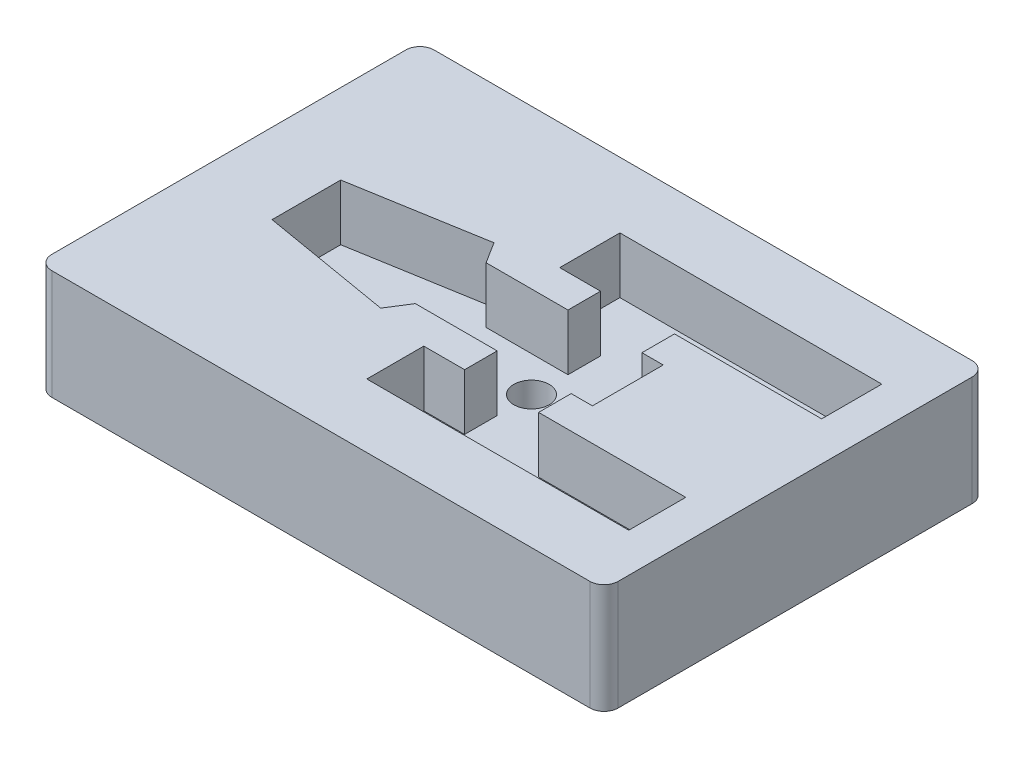
ISO-10303-21;
HEADER;
FILE_DESCRIPTION(('STEP AP214'),'2;1');
FILE_NAME('part.step','',(''),(''),'','','');
FILE_SCHEMA(('AUTOMOTIVE_DESIGN { 1 0 10303 214 1 1 1 1 }'));
ENDSEC;
DATA;
#1=APPLICATION_CONTEXT('core data for automotive mechanical design processes');
#2=APPLICATION_PROTOCOL_DEFINITION('international standard','automotive_design',2000,#1);
#3=PRODUCT_CONTEXT('',#1,'mechanical');
#4=PRODUCT('Part','Part','',(#3));
#5=PRODUCT_RELATED_PRODUCT_CATEGORY('part','',(#4));
#6=PRODUCT_DEFINITION_FORMATION('','',#4);
#7=PRODUCT_DEFINITION_CONTEXT('part definition',#1,'design');
#8=PRODUCT_DEFINITION('design','',#6,#7);
#9=PRODUCT_DEFINITION_SHAPE('','',#8);
#10=(LENGTH_UNIT() NAMED_UNIT(*) SI_UNIT(.MILLI.,.METRE.));
#11=(NAMED_UNIT(*) PLANE_ANGLE_UNIT() SI_UNIT($,.RADIAN.));
#12=(NAMED_UNIT(*) SI_UNIT($,.STERADIAN.) SOLID_ANGLE_UNIT());
#13=UNCERTAINTY_MEASURE_WITH_UNIT(LENGTH_MEASURE(1.E-05),#10,'distance_accuracy_value','');
#14=(GEOMETRIC_REPRESENTATION_CONTEXT(3) GLOBAL_UNCERTAINTY_ASSIGNED_CONTEXT((#13)) GLOBAL_UNIT_ASSIGNED_CONTEXT((#10,
#11,#12)) REPRESENTATION_CONTEXT('',''));
#15=CARTESIAN_POINT('',(0.,0.,0.));
#16=DIRECTION('',(0.,0.,1.));
#17=DIRECTION('',(1.,0.,0.));
#18=AXIS2_PLACEMENT_3D('',#15,#16,#17);
#19=CARTESIAN_POINT('',(43.1098166273303,1.58014703687218,-26.6450647658317));
#20=DIRECTION('',(0.,-1.,0.));
#21=DIRECTION('',(0.,0.,-1.));
#22=AXIS2_PLACEMENT_3D('',#19,#20,#21);
#23=PLANE('',#22);
#24=CARTESIAN_POINT('',(43.1098166273303,1.58014703687218,-26.6450647658317));
#25=DIRECTION('',(0.,-1.,0.));
#26=DIRECTION('',(0.,0.,-1.));
#27=AXIS2_PLACEMENT_3D('',#24,#25,#26);
#28=CIRCLE('',#27,2.5);
#29=CARTESIAN_POINT('',(43.1098166273303,1.58014703687218,-29.1450647658317));
#30=VERTEX_POINT('',#29);
#31=EDGE_CURVE('E267',#30,#30,#28,.T.);
#32=ORIENTED_EDGE('',*,*,#31,.F.);
#33=EDGE_LOOP('',(#32));
#34=FACE_BOUND('',#33,.T.);
#35=ADVANCED_FACE('F33',(#34),#23,.F.);
#36=CARTESIAN_POINT('',(43.1098166273303,1.58014703687218,-26.6450647658317));
#37=DIRECTION('',(0.,1.,0.));
#38=DIRECTION('',(0.,0.,1.));
#39=AXIS2_PLACEMENT_3D('',#36,#37,#38);
#40=CYLINDRICAL_SURFACE('',#39,2.5);
#41=ORIENTED_EDGE('',*,*,#31,.T.);
#42=EDGE_LOOP('',(#41));
#43=FACE_BOUND('',#42,.T.);
#44=CARTESIAN_POINT('',(43.1098166273303,7.58014703687218,-26.6450647658317));
#45=DIRECTION('',(0.,-1.,0.));
#46=DIRECTION('',(0.,0.,-1.));
#47=AXIS2_PLACEMENT_3D('',#44,#45,#46);
#48=CIRCLE('',#47,2.5);
#49=CARTESIAN_POINT('',(43.1098166273303,7.58014703687218,-29.1450647658317));
#50=VERTEX_POINT('',#49);
#51=EDGE_CURVE('E37',#50,#50,#48,.T.);
#52=ORIENTED_EDGE('',*,*,#51,.F.);
#53=EDGE_LOOP('',(#52));
#54=FACE_BOUND('',#53,.T.);
#55=ADVANCED_FACE('F479',(#43,#54),#40,.F.);
#56=CARTESIAN_POINT('',(-5.97748821274115,7.58014703687218,14.9746691358985));
#57=DIRECTION('',(0.,-1.,0.));
#58=DIRECTION('',(0.,0.,-1.));
#59=AXIS2_PLACEMENT_3D('',#56,#57,#58);
#60=PLANE('',#59);
#61=ORIENTED_EDGE('',*,*,#51,.T.);
#62=EDGE_LOOP('',(#61));
#63=FACE_BOUND('',#62,.T.);
#64=DIRECTION('',(-1.,0.,0.));
#65=VECTOR('',#64,1.);
#66=CARTESIAN_POINT('',(31.6989181121809,7.58014703687218,-31.6446674326943));
#67=LINE('',#66,#65);
#68=CARTESIAN_POINT('',(43.2613137873468,7.58014703687218,-31.6446674326943));
#69=VERTEX_POINT('',#68);
#70=CARTESIAN_POINT('',(31.6989181121809,7.58014703687218,-31.6446674326943));
#71=VERTEX_POINT('',#70);
#72=EDGE_CURVE('E258',#69,#71,#67,.T.);
#73=ORIENTED_EDGE('',*,*,#72,.T.);
#74=DIRECTION('',(-0.533212523299743,0.,-0.845981326623893));
#75=VECTOR('',#74,1.);
#76=CARTESIAN_POINT('',(29.8080518252346,7.58014703687218,-34.6446674326943));
#77=LINE('',#76,#75);
#78=CARTESIAN_POINT('',(29.8080518252346,7.58014703687218,-34.6446674326943));
#79=VERTEX_POINT('',#78);
#80=EDGE_CURVE('E246',#71,#79,#77,.T.);
#81=ORIENTED_EDGE('',*,*,#80,.T.);
#82=DIRECTION('',(-0.98578842750686,0.,0.167991595603927));
#83=VECTOR('',#82,1.);
#84=CARTESIAN_POINT('',(11.3098166273303,7.58014703687218,-31.4923195657063));
#85=LINE('',#84,#83);
#86=CARTESIAN_POINT('',(11.3098166273303,7.58014703687218,-31.4923195657063));
#87=VERTEX_POINT('',#86);
#88=EDGE_CURVE('E257',#79,#87,#85,.T.);
#89=ORIENTED_EDGE('',*,*,#88,.T.);
#90=DIRECTION('',(0.,0.,1.));
#91=VECTOR('',#90,1.);
#92=CARTESIAN_POINT('',(11.3098166273303,7.58014703687218,-31.4923195657063));
#93=LINE('',#92,#91);
#94=CARTESIAN_POINT('',(11.3098166273303,7.58014703687218,-21.7996674326943));
#95=VERTEX_POINT('',#94);
#96=EDGE_CURVE('E469',#87,#95,#93,.T.);
#97=ORIENTED_EDGE('',*,*,#96,.T.);
#98=DIRECTION('',(0.985765012883891,0.,0.168128936753978));
#99=VECTOR('',#98,1.);
#100=CARTESIAN_POINT('',(29.8080518252346,7.58014703687218,-18.6446674326943));
#101=LINE('',#100,#99);
#102=CARTESIAN_POINT('',(29.8080518252346,7.58014703687218,-18.6446674326943));
#103=VERTEX_POINT('',#102);
#104=EDGE_CURVE('E466',#95,#103,#101,.T.);
#105=ORIENTED_EDGE('',*,*,#104,.T.);
#106=DIRECTION('',(0.53321252329974,0.,-0.845981326623894));
#107=VECTOR('',#106,1.);
#108=CARTESIAN_POINT('',(31.6989181121809,7.58014703687218,-21.6446674326943));
#109=LINE('',#108,#107);
#110=CARTESIAN_POINT('',(31.6989181121809,7.58014703687218,-21.6446674326943));
#111=VERTEX_POINT('',#110);
#112=EDGE_CURVE('E463',#103,#111,#109,.T.);
#113=ORIENTED_EDGE('',*,*,#112,.T.);
#114=DIRECTION('',(1.,0.,0.));
#115=VECTOR('',#114,1.);
#116=CARTESIAN_POINT('',(31.6989181121809,7.58014703687218,-21.6446674326943));
#117=LINE('',#116,#115);
#118=CARTESIAN_POINT('',(43.2613137873468,7.58014703687218,-21.6446674326943));
#119=VERTEX_POINT('',#118);
#120=EDGE_CURVE('E460',#111,#119,#117,.T.);
#121=ORIENTED_EDGE('',*,*,#120,.T.);
#122=DIRECTION('',(0.,0.,1.));
#123=VECTOR('',#122,1.);
#124=CARTESIAN_POINT('',(43.2613137873468,7.58014703687218,-21.6446674326943));
#125=LINE('',#124,#123);
#126=CARTESIAN_POINT('',(43.2613137873468,7.58014703687218,-17.0446674326943));
#127=VERTEX_POINT('',#126);
#128=EDGE_CURVE('E457',#119,#127,#125,.T.);
#129=ORIENTED_EDGE('',*,*,#128,.T.);
#130=DIRECTION('',(-1.,0.,0.));
#131=VECTOR('',#130,1.);
#132=CARTESIAN_POINT('',(43.2613137873468,7.58014703687218,-17.0446674326943));
#133=LINE('',#132,#131);
#134=CARTESIAN_POINT('',(37.4956300892987,7.58014703687218,-17.0446674326943));
#135=VERTEX_POINT('',#134);
#136=EDGE_CURVE('E454',#127,#135,#133,.T.);
#137=ORIENTED_EDGE('',*,*,#136,.T.);
#138=DIRECTION('',(0.,0.,1.));
#139=VECTOR('',#138,1.);
#140=CARTESIAN_POINT('',(37.4956300892987,7.58014703687218,-17.0446674326943));
#141=LINE('',#140,#139);
#142=CARTESIAN_POINT('',(37.4956300892987,7.58014703687218,-8.99673393750217));
#143=VERTEX_POINT('',#142);
#144=EDGE_CURVE('E451',#135,#143,#141,.T.);
#145=ORIENTED_EDGE('',*,*,#144,.T.);
#146=DIRECTION('',(1.,0.,0.));
#147=VECTOR('',#146,1.);
#148=CARTESIAN_POINT('',(74.4956300892987,7.58014703687218,-8.99673393750218));
#149=LINE('',#148,#147);
#150=CARTESIAN_POINT('',(74.4956300892987,7.58014703687218,-8.99673393750218));
#151=VERTEX_POINT('',#150);
#152=EDGE_CURVE('E448',#143,#151,#149,.T.);
#153=ORIENTED_EDGE('',*,*,#152,.T.);
#154=DIRECTION('',(0.,0.,-1.));
#155=VECTOR('',#154,1.);
#156=CARTESIAN_POINT('',(74.4956300892987,7.58014703687218,-17.0446674326943));
#157=LINE('',#156,#155);
#158=CARTESIAN_POINT('',(74.4956300892987,7.58014703687218,-17.0446674326943));
#159=VERTEX_POINT('',#158);
#160=EDGE_CURVE('E445',#151,#159,#157,.T.);
#161=ORIENTED_EDGE('',*,*,#160,.T.);
#162=DIRECTION('',(-1.,0.,0.));
#163=VECTOR('',#162,1.);
#164=CARTESIAN_POINT('',(74.4956300892987,7.58014703687218,-17.0446674326943));
#165=LINE('',#164,#163);
#166=CARTESIAN_POINT('',(53.711615490059,7.58014703687218,-17.0446674326943));
#167=VERTEX_POINT('',#166);
#168=EDGE_CURVE('E442',#159,#167,#165,.T.);
#169=ORIENTED_EDGE('',*,*,#168,.T.);
#170=DIRECTION('',(0.,0.,-1.));
#171=VECTOR('',#170,1.);
#172=CARTESIAN_POINT('',(53.711615490059,7.58014703687218,-21.6446674326943));
#173=LINE('',#172,#171);
#174=CARTESIAN_POINT('',(53.711615490059,7.58014703687218,-21.6446674326943));
#175=VERTEX_POINT('',#174);
#176=EDGE_CURVE('E439',#167,#175,#173,.T.);
#177=ORIENTED_EDGE('',*,*,#176,.T.);
#178=DIRECTION('',(1.,0.,0.));
#179=VECTOR('',#178,1.);
#180=CARTESIAN_POINT('',(53.711615490059,7.58014703687218,-21.6446674326943));
#181=LINE('',#180,#179);
#182=CARTESIAN_POINT('',(56.7145757494591,7.58014703687218,-21.6446674326943));
#183=VERTEX_POINT('',#182);
#184=EDGE_CURVE('E436',#175,#183,#181,.T.);
#185=ORIENTED_EDGE('',*,*,#184,.T.);
#186=DIRECTION('',(0.,0.,-1.));
#187=VECTOR('',#186,1.);
#188=CARTESIAN_POINT('',(56.7145757494591,7.58014703687218,-31.6446674326943));
#189=LINE('',#188,#187);
#190=CARTESIAN_POINT('',(56.7145757494591,7.58014703687218,-31.6446674326943));
#191=VERTEX_POINT('',#190);
#192=EDGE_CURVE('E433',#183,#191,#189,.T.);
#193=ORIENTED_EDGE('',*,*,#192,.T.);
#194=DIRECTION('',(-1.,0.,0.));
#195=VECTOR('',#194,1.);
#196=CARTESIAN_POINT('',(53.711615490059,7.58014703687218,-31.6446674326943));
#197=LINE('',#196,#195);
#198=CARTESIAN_POINT('',(53.711615490059,7.58014703687218,-31.6446674326943));
#199=VERTEX_POINT('',#198);
#200=EDGE_CURVE('E430',#191,#199,#197,.T.);
#201=ORIENTED_EDGE('',*,*,#200,.T.);
#202=DIRECTION('',(0.,0.,-1.));
#203=VECTOR('',#202,1.);
#204=CARTESIAN_POINT('',(53.711615490059,7.58014703687218,-36.2446674326943));
#205=LINE('',#204,#203);
#206=CARTESIAN_POINT('',(53.711615490059,7.58014703687218,-36.2446674326943));
#207=VERTEX_POINT('',#206);
#208=EDGE_CURVE('E427',#199,#207,#205,.T.);
#209=ORIENTED_EDGE('',*,*,#208,.T.);
#210=DIRECTION('',(1.,0.,0.));
#211=VECTOR('',#210,1.);
#212=CARTESIAN_POINT('',(53.711615490059,7.58014703687218,-36.2446674326943));
#213=LINE('',#212,#211);
#214=CARTESIAN_POINT('',(74.4956300892987,7.58014703687218,-36.2446674326943));
#215=VERTEX_POINT('',#214);
#216=EDGE_CURVE('E424',#207,#215,#213,.T.);
#217=ORIENTED_EDGE('',*,*,#216,.T.);
#218=DIRECTION('',(0.,0.,-1.));
#219=VECTOR('',#218,1.);
#220=CARTESIAN_POINT('',(74.4956300892987,7.58014703687218,-44.7446674326943));
#221=LINE('',#220,#219);
#222=CARTESIAN_POINT('',(74.4956300892987,7.58014703687218,-44.7446674326943));
#223=VERTEX_POINT('',#222);
#224=EDGE_CURVE('E421',#215,#223,#221,.T.);
#225=ORIENTED_EDGE('',*,*,#224,.T.);
#226=DIRECTION('',(-1.,0.,0.));
#227=VECTOR('',#226,1.);
#228=CARTESIAN_POINT('',(37.4956300892987,7.58014703687218,-44.7446674326943));
#229=LINE('',#228,#227);
#230=CARTESIAN_POINT('',(37.4956300892987,7.58014703687218,-44.7446674326943));
#231=VERTEX_POINT('',#230);
#232=EDGE_CURVE('E418',#223,#231,#229,.T.);
#233=ORIENTED_EDGE('',*,*,#232,.T.);
#234=DIRECTION('',(0.,0.,1.));
#235=VECTOR('',#234,1.);
#236=CARTESIAN_POINT('',(37.4956300892987,7.58014703687218,-44.7446674326943));
#237=LINE('',#236,#235);
#238=CARTESIAN_POINT('',(37.4956300892987,7.58014703687218,-36.2446674326943));
#239=VERTEX_POINT('',#238);
#240=EDGE_CURVE('E415',#231,#239,#237,.T.);
#241=ORIENTED_EDGE('',*,*,#240,.T.);
#242=DIRECTION('',(1.,0.,0.));
#243=VECTOR('',#242,1.);
#244=CARTESIAN_POINT('',(37.4956300892987,7.58014703687218,-36.2446674326943));
#245=LINE('',#244,#243);
#246=CARTESIAN_POINT('',(43.2613137873468,7.58014703687218,-36.2446674326943));
#247=VERTEX_POINT('',#246);
#248=EDGE_CURVE('E413',#239,#247,#245,.T.);
#249=ORIENTED_EDGE('',*,*,#248,.T.);
#250=DIRECTION('',(0.,0.,1.));
#251=VECTOR('',#250,1.);
#252=CARTESIAN_POINT('',(43.2613137873468,7.58014703687218,-36.2446674326943));
#253=LINE('',#252,#251);
#254=EDGE_CURVE('E263',#247,#69,#253,.T.);
#255=ORIENTED_EDGE('',*,*,#254,.T.);
#256=EDGE_LOOP('',(#73,#81,#89,#97,#105,#113,#121,#129,#137,#145,#153,#161,#169,#177,#185,#193,
#201,#209,#217,#225,#233,#241,#249,#255));
#257=FACE_BOUND('',#256,.T.);
#258=ADVANCED_FACE('F261',(#63,#257),#60,.F.);
#259=CARTESIAN_POINT('',(43.2613137873468,15.5801470368722,-36.2446674326943));
#260=DIRECTION('',(1.,0.,0.));
#261=DIRECTION('',(0.,0.,-1.));
#262=AXIS2_PLACEMENT_3D('',#259,#260,#261);
#263=PLANE('',#262);
#264=DIRECTION('',(0.,0.,1.));
#265=VECTOR('',#264,1.);
#266=CARTESIAN_POINT('',(43.2613137873469,15.5,0.));
#267=LINE('',#266,#265);
#268=CARTESIAN_POINT('',(43.2613137873468,15.5,-36.2446674326943));
#269=VERTEX_POINT('',#268);
#270=CARTESIAN_POINT('',(43.2613137873468,15.5,-31.6446674326943));
#271=VERTEX_POINT('',#270);
#272=EDGE_CURVE('E272',#269,#271,#267,.T.);
#273=ORIENTED_EDGE('',*,*,#272,.T.);
#274=DIRECTION('',(0.,-1.,0.));
#275=VECTOR('',#274,1.);
#276=CARTESIAN_POINT('',(43.2613137873468,15.5801470368722,-31.6446674326943));
#277=LINE('',#276,#275);
#278=EDGE_CURVE('E344',#271,#69,#277,.T.);
#279=ORIENTED_EDGE('',*,*,#278,.T.);
#280=ORIENTED_EDGE('',*,*,#254,.F.);
#281=DIRECTION('',(0.,-1.,0.));
#282=VECTOR('',#281,1.);
#283=CARTESIAN_POINT('',(43.2613137873468,15.5801470368722,-36.2446674326943));
#284=LINE('',#283,#282);
#285=EDGE_CURVE('E341',#269,#247,#284,.T.);
#286=ORIENTED_EDGE('',*,*,#285,.F.);
#287=EDGE_LOOP('',(#273,#279,#280,#286));
#288=FACE_BOUND('',#287,.T.);
#289=ADVANCED_FACE('F486',(#288),#263,.T.);
#290=CARTESIAN_POINT('',(37.4956300892987,15.5801470368722,-36.2446674326943));
#291=DIRECTION('',(0.,0.,-1.));
#292=DIRECTION('',(-1.,0.,0.));
#293=AXIS2_PLACEMENT_3D('',#290,#291,#292);
#294=PLANE('',#293);
#295=DIRECTION('',(1.,0.,0.));
#296=VECTOR('',#295,1.);
#297=CARTESIAN_POINT('',(0.,15.5,-36.2446674326943));
#298=LINE('',#297,#296);
#299=CARTESIAN_POINT('',(37.4956300892987,15.5,-36.2446674326943));
#300=VERTEX_POINT('',#299);
#301=EDGE_CURVE('E274',#300,#269,#298,.T.);
#302=ORIENTED_EDGE('',*,*,#301,.T.);
#303=ORIENTED_EDGE('',*,*,#285,.T.);
#304=ORIENTED_EDGE('',*,*,#248,.F.);
#305=DIRECTION('',(0.,-1.,0.));
#306=VECTOR('',#305,1.);
#307=CARTESIAN_POINT('',(37.4956300892987,15.5801470368722,-36.2446674326943));
#308=LINE('',#307,#306);
#309=EDGE_CURVE('E338',#300,#239,#308,.T.);
#310=ORIENTED_EDGE('',*,*,#309,.F.);
#311=EDGE_LOOP('',(#302,#303,#304,#310));
#312=FACE_BOUND('',#311,.T.);
#313=ADVANCED_FACE('F606',(#312),#294,.T.);
#314=CARTESIAN_POINT('',(37.4956300892987,15.5801470368722,-44.7446674326943));
#315=DIRECTION('',(1.,0.,0.));
#316=DIRECTION('',(0.,0.,-1.));
#317=AXIS2_PLACEMENT_3D('',#314,#315,#316);
#318=PLANE('',#317);
#319=DIRECTION('',(0.,0.,1.));
#320=VECTOR('',#319,1.);
#321=CARTESIAN_POINT('',(37.4956300892987,15.5,0.));
#322=LINE('',#321,#320);
#323=CARTESIAN_POINT('',(37.4956300892987,15.5,-44.7446674326943));
#324=VERTEX_POINT('',#323);
#325=EDGE_CURVE('E407',#324,#300,#322,.T.);
#326=ORIENTED_EDGE('',*,*,#325,.T.);
#327=ORIENTED_EDGE('',*,*,#309,.T.);
#328=ORIENTED_EDGE('',*,*,#240,.F.);
#329=DIRECTION('',(0.,-1.,0.));
#330=VECTOR('',#329,1.);
#331=CARTESIAN_POINT('',(37.4956300892987,15.5801470368722,-44.7446674326943));
#332=LINE('',#331,#330);
#333=EDGE_CURVE('E335',#324,#231,#332,.T.);
#334=ORIENTED_EDGE('',*,*,#333,.F.);
#335=EDGE_LOOP('',(#326,#327,#328,#334));
#336=FACE_BOUND('',#335,.T.);
#337=ADVANCED_FACE('F602',(#336),#318,.T.);
#338=CARTESIAN_POINT('',(37.4956300892987,15.5801470368722,-44.7446674326943));
#339=DIRECTION('',(0.,0.,1.));
#340=DIRECTION('',(1.,0.,0.));
#341=AXIS2_PLACEMENT_3D('',#338,#339,#340);
#342=PLANE('',#341);
#343=DIRECTION('',(-1.,0.,0.));
#344=VECTOR('',#343,1.);
#345=CARTESIAN_POINT('',(0.,15.5,-44.7446674326943));
#346=LINE('',#345,#344);
#347=CARTESIAN_POINT('',(74.4956300892987,15.5,-44.7446674326943));
#348=VERTEX_POINT('',#347);
#349=EDGE_CURVE('E404',#348,#324,#346,.T.);
#350=ORIENTED_EDGE('',*,*,#349,.T.);
#351=ORIENTED_EDGE('',*,*,#333,.T.);
#352=ORIENTED_EDGE('',*,*,#232,.F.);
#353=DIRECTION('',(0.,-1.,0.));
#354=VECTOR('',#353,1.);
#355=CARTESIAN_POINT('',(74.4956300892987,15.5801470368722,-44.7446674326943));
#356=LINE('',#355,#354);
#357=EDGE_CURVE('E332',#348,#223,#356,.T.);
#358=ORIENTED_EDGE('',*,*,#357,.F.);
#359=EDGE_LOOP('',(#350,#351,#352,#358));
#360=FACE_BOUND('',#359,.T.);
#361=ADVANCED_FACE('F598',(#360),#342,.T.);
#362=CARTESIAN_POINT('',(74.4956300892987,15.5801470368722,-44.7446674326943));
#363=DIRECTION('',(-1.,0.,0.));
#364=DIRECTION('',(0.,0.,1.));
#365=AXIS2_PLACEMENT_3D('',#362,#363,#364);
#366=PLANE('',#365);
#367=DIRECTION('',(0.,0.,-1.));
#368=VECTOR('',#367,1.);
#369=CARTESIAN_POINT('',(74.4956300892987,15.5,0.));
#370=LINE('',#369,#368);
#371=CARTESIAN_POINT('',(74.4956300892987,15.5,-36.2446674326943));
#372=VERTEX_POINT('',#371);
#373=EDGE_CURVE('E401',#372,#348,#370,.T.);
#374=ORIENTED_EDGE('',*,*,#373,.T.);
#375=ORIENTED_EDGE('',*,*,#357,.T.);
#376=ORIENTED_EDGE('',*,*,#224,.F.);
#377=DIRECTION('',(0.,-1.,0.));
#378=VECTOR('',#377,1.);
#379=CARTESIAN_POINT('',(74.4956300892987,15.5801470368722,-36.2446674326943));
#380=LINE('',#379,#378);
#381=EDGE_CURVE('E329',#372,#215,#380,.T.);
#382=ORIENTED_EDGE('',*,*,#381,.F.);
#383=EDGE_LOOP('',(#374,#375,#376,#382));
#384=FACE_BOUND('',#383,.T.);
#385=ADVANCED_FACE('F594',(#384),#366,.T.);
#386=CARTESIAN_POINT('',(53.711615490059,15.5801470368722,-36.2446674326943));
#387=DIRECTION('',(0.,0.,-1.));
#388=DIRECTION('',(-1.,0.,0.));
#389=AXIS2_PLACEMENT_3D('',#386,#387,#388);
#390=PLANE('',#389);
#391=DIRECTION('',(1.,0.,0.));
#392=VECTOR('',#391,1.);
#393=CARTESIAN_POINT('',(0.,15.5,-36.2446674326943));
#394=LINE('',#393,#392);
#395=CARTESIAN_POINT('',(53.711615490059,15.5,-36.2446674326943));
#396=VERTEX_POINT('',#395);
#397=EDGE_CURVE('E398',#396,#372,#394,.T.);
#398=ORIENTED_EDGE('',*,*,#397,.T.);
#399=ORIENTED_EDGE('',*,*,#381,.T.);
#400=ORIENTED_EDGE('',*,*,#216,.F.);
#401=DIRECTION('',(0.,-1.,0.));
#402=VECTOR('',#401,1.);
#403=CARTESIAN_POINT('',(53.711615490059,15.5801470368722,-36.2446674326943));
#404=LINE('',#403,#402);
#405=EDGE_CURVE('E326',#396,#207,#404,.T.);
#406=ORIENTED_EDGE('',*,*,#405,.F.);
#407=EDGE_LOOP('',(#398,#399,#400,#406));
#408=FACE_BOUND('',#407,.T.);
#409=ADVANCED_FACE('F590',(#408),#390,.T.);
#410=CARTESIAN_POINT('',(53.711615490059,15.5801470368722,-36.2446674326943));
#411=DIRECTION('',(-1.,0.,0.));
#412=DIRECTION('',(0.,0.,1.));
#413=AXIS2_PLACEMENT_3D('',#410,#411,#412);
#414=PLANE('',#413);
#415=DIRECTION('',(0.,0.,-1.));
#416=VECTOR('',#415,1.);
#417=CARTESIAN_POINT('',(53.7116154900591,15.5,0.));
#418=LINE('',#417,#416);
#419=CARTESIAN_POINT('',(53.711615490059,15.5,-31.6446674326943));
#420=VERTEX_POINT('',#419);
#421=EDGE_CURVE('E395',#420,#396,#418,.T.);
#422=ORIENTED_EDGE('',*,*,#421,.T.);
#423=ORIENTED_EDGE('',*,*,#405,.T.);
#424=ORIENTED_EDGE('',*,*,#208,.F.);
#425=DIRECTION('',(0.,-1.,0.));
#426=VECTOR('',#425,1.);
#427=CARTESIAN_POINT('',(53.711615490059,15.5801470368722,-31.6446674326943));
#428=LINE('',#427,#426);
#429=EDGE_CURVE('E323',#420,#199,#428,.T.);
#430=ORIENTED_EDGE('',*,*,#429,.F.);
#431=EDGE_LOOP('',(#422,#423,#424,#430));
#432=FACE_BOUND('',#431,.T.);
#433=ADVANCED_FACE('F586',(#432),#414,.T.);
#434=CARTESIAN_POINT('',(53.711615490059,15.5801470368722,-31.6446674326943));
#435=DIRECTION('',(0.,0.,1.));
#436=DIRECTION('',(1.,0.,0.));
#437=AXIS2_PLACEMENT_3D('',#434,#435,#436);
#438=PLANE('',#437);
#439=DIRECTION('',(-1.,0.,0.));
#440=VECTOR('',#439,1.);
#441=CARTESIAN_POINT('',(0.,15.5,-31.6446674326943));
#442=LINE('',#441,#440);
#443=CARTESIAN_POINT('',(56.7145757494591,15.5,-31.6446674326943));
#444=VERTEX_POINT('',#443);
#445=EDGE_CURVE('E392',#444,#420,#442,.T.);
#446=ORIENTED_EDGE('',*,*,#445,.T.);
#447=ORIENTED_EDGE('',*,*,#429,.T.);
#448=ORIENTED_EDGE('',*,*,#200,.F.);
#449=DIRECTION('',(0.,-1.,0.));
#450=VECTOR('',#449,1.);
#451=CARTESIAN_POINT('',(56.7145757494591,15.5801470368722,-31.6446674326943));
#452=LINE('',#451,#450);
#453=EDGE_CURVE('E320',#444,#191,#452,.T.);
#454=ORIENTED_EDGE('',*,*,#453,.F.);
#455=EDGE_LOOP('',(#446,#447,#448,#454));
#456=FACE_BOUND('',#455,.T.);
#457=ADVANCED_FACE('F582',(#456),#438,.T.);
#458=CARTESIAN_POINT('',(56.7145757494591,15.5801470368722,-31.6446674326943));
#459=DIRECTION('',(-1.,0.,0.));
#460=DIRECTION('',(0.,0.,1.));
#461=AXIS2_PLACEMENT_3D('',#458,#459,#460);
#462=PLANE('',#461);
#463=DIRECTION('',(0.,0.,-1.));
#464=VECTOR('',#463,1.);
#465=CARTESIAN_POINT('',(56.7145757494591,15.5,0.));
#466=LINE('',#465,#464);
#467=CARTESIAN_POINT('',(56.7145757494591,15.5,-21.6446674326943));
#468=VERTEX_POINT('',#467);
#469=EDGE_CURVE('E389',#468,#444,#466,.T.);
#470=ORIENTED_EDGE('',*,*,#469,.T.);
#471=ORIENTED_EDGE('',*,*,#453,.T.);
#472=ORIENTED_EDGE('',*,*,#192,.F.);
#473=DIRECTION('',(0.,-1.,0.));
#474=VECTOR('',#473,1.);
#475=CARTESIAN_POINT('',(56.7145757494591,15.5801470368722,-21.6446674326943));
#476=LINE('',#475,#474);
#477=EDGE_CURVE('E317',#468,#183,#476,.T.);
#478=ORIENTED_EDGE('',*,*,#477,.F.);
#479=EDGE_LOOP('',(#470,#471,#472,#478));
#480=FACE_BOUND('',#479,.T.);
#481=ADVANCED_FACE('F578',(#480),#462,.T.);
#482=CARTESIAN_POINT('',(53.711615490059,15.5801470368722,-21.6446674326943));
#483=DIRECTION('',(0.,0.,-1.));
#484=DIRECTION('',(-1.,0.,0.));
#485=AXIS2_PLACEMENT_3D('',#482,#483,#484);
#486=PLANE('',#485);
#487=DIRECTION('',(1.,0.,0.));
#488=VECTOR('',#487,1.);
#489=CARTESIAN_POINT('',(0.,15.5,-21.6446674326943));
#490=LINE('',#489,#488);
#491=CARTESIAN_POINT('',(53.711615490059,15.5,-21.6446674326943));
#492=VERTEX_POINT('',#491);
#493=EDGE_CURVE('E386',#492,#468,#490,.T.);
#494=ORIENTED_EDGE('',*,*,#493,.T.);
#495=ORIENTED_EDGE('',*,*,#477,.T.);
#496=ORIENTED_EDGE('',*,*,#184,.F.);
#497=DIRECTION('',(0.,-1.,0.));
#498=VECTOR('',#497,1.);
#499=CARTESIAN_POINT('',(53.711615490059,15.5801470368722,-21.6446674326943));
#500=LINE('',#499,#498);
#501=EDGE_CURVE('E314',#492,#175,#500,.T.);
#502=ORIENTED_EDGE('',*,*,#501,.F.);
#503=EDGE_LOOP('',(#494,#495,#496,#502));
#504=FACE_BOUND('',#503,.T.);
#505=ADVANCED_FACE('F574',(#504),#486,.T.);
#506=CARTESIAN_POINT('',(53.711615490059,15.5801470368722,-21.6446674326943));
#507=DIRECTION('',(-1.,0.,0.));
#508=DIRECTION('',(0.,0.,1.));
#509=AXIS2_PLACEMENT_3D('',#506,#507,#508);
#510=PLANE('',#509);
#511=DIRECTION('',(0.,0.,-1.));
#512=VECTOR('',#511,1.);
#513=CARTESIAN_POINT('',(53.711615490059,15.5,0.));
#514=LINE('',#513,#512);
#515=CARTESIAN_POINT('',(53.711615490059,15.5,-17.0446674326943));
#516=VERTEX_POINT('',#515);
#517=EDGE_CURVE('E383',#516,#492,#514,.T.);
#518=ORIENTED_EDGE('',*,*,#517,.T.);
#519=ORIENTED_EDGE('',*,*,#501,.T.);
#520=ORIENTED_EDGE('',*,*,#176,.F.);
#521=DIRECTION('',(0.,-1.,0.));
#522=VECTOR('',#521,1.);
#523=CARTESIAN_POINT('',(53.711615490059,15.5801470368722,-17.0446674326943));
#524=LINE('',#523,#522);
#525=EDGE_CURVE('E311',#516,#167,#524,.T.);
#526=ORIENTED_EDGE('',*,*,#525,.F.);
#527=EDGE_LOOP('',(#518,#519,#520,#526));
#528=FACE_BOUND('',#527,.T.);
#529=ADVANCED_FACE('F570',(#528),#510,.T.);
#530=CARTESIAN_POINT('',(74.4956300892987,15.5801470368722,-17.0446674326943));
#531=DIRECTION('',(0.,0.,1.));
#532=DIRECTION('',(1.,0.,0.));
#533=AXIS2_PLACEMENT_3D('',#530,#531,#532);
#534=PLANE('',#533);
#535=DIRECTION('',(-1.,0.,0.));
#536=VECTOR('',#535,1.);
#537=CARTESIAN_POINT('',(0.,15.5,-17.0446674326943));
#538=LINE('',#537,#536);
#539=CARTESIAN_POINT('',(74.4956300892987,15.5,-17.0446674326943));
#540=VERTEX_POINT('',#539);
#541=EDGE_CURVE('E380',#540,#516,#538,.T.);
#542=ORIENTED_EDGE('',*,*,#541,.T.);
#543=ORIENTED_EDGE('',*,*,#525,.T.);
#544=ORIENTED_EDGE('',*,*,#168,.F.);
#545=DIRECTION('',(0.,-1.,0.));
#546=VECTOR('',#545,1.);
#547=CARTESIAN_POINT('',(74.4956300892987,15.5801470368722,-17.0446674326943));
#548=LINE('',#547,#546);
#549=EDGE_CURVE('E308',#540,#159,#548,.T.);
#550=ORIENTED_EDGE('',*,*,#549,.F.);
#551=EDGE_LOOP('',(#542,#543,#544,#550));
#552=FACE_BOUND('',#551,.T.);
#553=ADVANCED_FACE('F566',(#552),#534,.T.);
#554=CARTESIAN_POINT('',(74.4956300892987,15.5801470368722,-17.0446674326943));
#555=DIRECTION('',(-1.,0.,0.));
#556=DIRECTION('',(0.,0.,1.));
#557=AXIS2_PLACEMENT_3D('',#554,#555,#556);
#558=PLANE('',#557);
#559=DIRECTION('',(0.,0.,-1.));
#560=VECTOR('',#559,1.);
#561=CARTESIAN_POINT('',(74.4956300892987,15.5,-1.28459628500452E-13));
#562=LINE('',#561,#560);
#563=CARTESIAN_POINT('',(74.4956300892987,15.5,-8.99673393750218));
#564=VERTEX_POINT('',#563);
#565=EDGE_CURVE('E377',#564,#540,#562,.T.);
#566=ORIENTED_EDGE('',*,*,#565,.T.);
#567=ORIENTED_EDGE('',*,*,#549,.T.);
#568=ORIENTED_EDGE('',*,*,#160,.F.);
#569=DIRECTION('',(0.,-1.,0.));
#570=VECTOR('',#569,1.);
#571=CARTESIAN_POINT('',(74.4956300892987,15.5801470368722,-8.99673393750218));
#572=LINE('',#571,#570);
#573=EDGE_CURVE('E305',#564,#151,#572,.T.);
#574=ORIENTED_EDGE('',*,*,#573,.F.);
#575=EDGE_LOOP('',(#566,#567,#568,#574));
#576=FACE_BOUND('',#575,.T.);
#577=ADVANCED_FACE('F562',(#576),#558,.T.);
#578=CARTESIAN_POINT('',(74.4956300892987,15.5801470368722,-8.99673393750218));
#579=DIRECTION('',(0.,0.,-1.));
#580=DIRECTION('',(-1.,0.,0.));
#581=AXIS2_PLACEMENT_3D('',#578,#579,#580);
#582=PLANE('',#581);
#583=DIRECTION('',(1.,0.,0.));
#584=VECTOR('',#583,1.);
#585=CARTESIAN_POINT('',(0.,15.5,-8.99673393750215));
#586=LINE('',#585,#584);
#587=CARTESIAN_POINT('',(37.4956300892987,15.5,-8.99673393750217));
#588=VERTEX_POINT('',#587);
#589=EDGE_CURVE('E374',#588,#564,#586,.T.);
#590=ORIENTED_EDGE('',*,*,#589,.T.);
#591=ORIENTED_EDGE('',*,*,#573,.T.);
#592=ORIENTED_EDGE('',*,*,#152,.F.);
#593=DIRECTION('',(0.,-1.,0.));
#594=VECTOR('',#593,1.);
#595=CARTESIAN_POINT('',(37.4956300892987,15.5801470368722,-8.99673393750217));
#596=LINE('',#595,#594);
#597=EDGE_CURVE('E302',#588,#143,#596,.T.);
#598=ORIENTED_EDGE('',*,*,#597,.F.);
#599=EDGE_LOOP('',(#590,#591,#592,#598));
#600=FACE_BOUND('',#599,.T.);
#601=ADVANCED_FACE('F558',(#600),#582,.T.);
#602=CARTESIAN_POINT('',(37.4956300892987,15.5801470368722,-17.0446674326943));
#603=DIRECTION('',(1.,0.,0.));
#604=DIRECTION('',(0.,0.,-1.));
#605=AXIS2_PLACEMENT_3D('',#602,#603,#604);
#606=PLANE('',#605);
#607=DIRECTION('',(0.,0.,1.));
#608=VECTOR('',#607,1.);
#609=CARTESIAN_POINT('',(37.4956300892987,15.5,0.));
#610=LINE('',#609,#608);
#611=CARTESIAN_POINT('',(37.4956300892987,15.5,-17.0446674326943));
#612=VERTEX_POINT('',#611);
#613=EDGE_CURVE('E371',#612,#588,#610,.T.);
#614=ORIENTED_EDGE('',*,*,#613,.T.);
#615=ORIENTED_EDGE('',*,*,#597,.T.);
#616=ORIENTED_EDGE('',*,*,#144,.F.);
#617=DIRECTION('',(0.,-1.,0.));
#618=VECTOR('',#617,1.);
#619=CARTESIAN_POINT('',(37.4956300892987,15.5801470368722,-17.0446674326943));
#620=LINE('',#619,#618);
#621=EDGE_CURVE('E299',#612,#135,#620,.T.);
#622=ORIENTED_EDGE('',*,*,#621,.F.);
#623=EDGE_LOOP('',(#614,#615,#616,#622));
#624=FACE_BOUND('',#623,.T.);
#625=ADVANCED_FACE('F554',(#624),#606,.T.);
#626=CARTESIAN_POINT('',(43.2613137873468,15.5801470368722,-17.0446674326943));
#627=DIRECTION('',(0.,0.,1.));
#628=DIRECTION('',(1.,0.,0.));
#629=AXIS2_PLACEMENT_3D('',#626,#627,#628);
#630=PLANE('',#629);
#631=DIRECTION('',(-1.,0.,0.));
#632=VECTOR('',#631,1.);
#633=CARTESIAN_POINT('',(0.,15.5,-17.0446674326943));
#634=LINE('',#633,#632);
#635=CARTESIAN_POINT('',(43.2613137873468,15.5,-17.0446674326943));
#636=VERTEX_POINT('',#635);
#637=EDGE_CURVE('E368',#636,#612,#634,.T.);
#638=ORIENTED_EDGE('',*,*,#637,.T.);
#639=ORIENTED_EDGE('',*,*,#621,.T.);
#640=ORIENTED_EDGE('',*,*,#136,.F.);
#641=DIRECTION('',(0.,-1.,0.));
#642=VECTOR('',#641,1.);
#643=CARTESIAN_POINT('',(43.2613137873468,15.5801470368722,-17.0446674326943));
#644=LINE('',#643,#642);
#645=EDGE_CURVE('E296',#636,#127,#644,.T.);
#646=ORIENTED_EDGE('',*,*,#645,.F.);
#647=EDGE_LOOP('',(#638,#639,#640,#646));
#648=FACE_BOUND('',#647,.T.);
#649=ADVANCED_FACE('F550',(#648),#630,.T.);
#650=CARTESIAN_POINT('',(43.2613137873468,15.5801470368722,-21.6446674326943));
#651=DIRECTION('',(1.,0.,0.));
#652=DIRECTION('',(0.,0.,-1.));
#653=AXIS2_PLACEMENT_3D('',#650,#651,#652);
#654=PLANE('',#653);
#655=DIRECTION('',(0.,0.,1.));
#656=VECTOR('',#655,1.);
#657=CARTESIAN_POINT('',(43.2613137873468,15.5,0.));
#658=LINE('',#657,#656);
#659=CARTESIAN_POINT('',(43.2613137873468,15.5,-21.6446674326943));
#660=VERTEX_POINT('',#659);
#661=EDGE_CURVE('E365',#660,#636,#658,.T.);
#662=ORIENTED_EDGE('',*,*,#661,.T.);
#663=ORIENTED_EDGE('',*,*,#645,.T.);
#664=ORIENTED_EDGE('',*,*,#128,.F.);
#665=DIRECTION('',(0.,-1.,0.));
#666=VECTOR('',#665,1.);
#667=CARTESIAN_POINT('',(43.2613137873468,15.5801470368722,-21.6446674326943));
#668=LINE('',#667,#666);
#669=EDGE_CURVE('E293',#660,#119,#668,.T.);
#670=ORIENTED_EDGE('',*,*,#669,.F.);
#671=EDGE_LOOP('',(#662,#663,#664,#670));
#672=FACE_BOUND('',#671,.T.);
#673=ADVANCED_FACE('F546',(#672),#654,.T.);
#674=CARTESIAN_POINT('',(31.6989181121809,15.5801470368722,-21.6446674326943));
#675=DIRECTION('',(0.,0.,-1.));
#676=DIRECTION('',(-1.,0.,0.));
#677=AXIS2_PLACEMENT_3D('',#674,#675,#676);
#678=PLANE('',#677);
#679=DIRECTION('',(1.,0.,0.));
#680=VECTOR('',#679,1.);
#681=CARTESIAN_POINT('',(0.,15.5,-21.6446674326943));
#682=LINE('',#681,#680);
#683=CARTESIAN_POINT('',(31.6989181121809,15.5,-21.6446674326943));
#684=VERTEX_POINT('',#683);
#685=EDGE_CURVE('E362',#684,#660,#682,.T.);
#686=ORIENTED_EDGE('',*,*,#685,.T.);
#687=ORIENTED_EDGE('',*,*,#669,.T.);
#688=ORIENTED_EDGE('',*,*,#120,.F.);
#689=DIRECTION('',(0.,-1.,0.));
#690=VECTOR('',#689,1.);
#691=CARTESIAN_POINT('',(31.6989181121809,15.5801470368722,-21.6446674326943));
#692=LINE('',#691,#690);
#693=EDGE_CURVE('E290',#684,#111,#692,.T.);
#694=ORIENTED_EDGE('',*,*,#693,.F.);
#695=EDGE_LOOP('',(#686,#687,#688,#694));
#696=FACE_BOUND('',#695,.T.);
#697=ADVANCED_FACE('F542',(#696),#678,.T.);
#698=CARTESIAN_POINT('',(31.6989181121809,15.5801470368722,-21.6446674326943));
#699=DIRECTION('',(-0.845981326623894,0.,-0.53321252329974));
#700=DIRECTION('',(-0.53321252329974,0.,0.845981326623894));
#701=AXIS2_PLACEMENT_3D('',#698,#699,#700);
#702=PLANE('',#701);
#703=DIRECTION('',(0.53321252329974,0.,-0.845981326623894));
#704=VECTOR('',#703,1.);
#705=CARTESIAN_POINT('',(12.9227751153023,15.5,8.14507993310449));
#706=LINE('',#705,#704);
#707=CARTESIAN_POINT('',(29.8080518252346,15.5,-18.6446674326943));
#708=VERTEX_POINT('',#707);
#709=EDGE_CURVE('E359',#708,#684,#706,.T.);
#710=ORIENTED_EDGE('',*,*,#709,.T.);
#711=ORIENTED_EDGE('',*,*,#693,.T.);
#712=ORIENTED_EDGE('',*,*,#112,.F.);
#713=DIRECTION('',(0.,-1.,0.));
#714=VECTOR('',#713,1.);
#715=CARTESIAN_POINT('',(29.8080518252346,15.5801470368722,-18.6446674326943));
#716=LINE('',#715,#714);
#717=EDGE_CURVE('E287',#708,#103,#716,.T.);
#718=ORIENTED_EDGE('',*,*,#717,.F.);
#719=EDGE_LOOP('',(#710,#711,#712,#718));
#720=FACE_BOUND('',#719,.T.);
#721=ADVANCED_FACE('F538',(#720),#702,.T.);
#722=CARTESIAN_POINT('',(29.8080518252346,15.5801470368722,-18.6446674326943));
#723=DIRECTION('',(0.168128936753978,0.,-0.985765012883891));
#724=DIRECTION('',(-0.985765012883891,0.,-0.168128936753978));
#725=AXIS2_PLACEMENT_3D('',#722,#723,#724);
#726=PLANE('',#725);
#727=DIRECTION('',(0.985765012883891,0.,0.168128936753978));
#728=VECTOR('',#727,1.);
#729=CARTESIAN_POINT('',(3.93267989903154,15.5,-23.0578883455963));
#730=LINE('',#729,#728);
#731=CARTESIAN_POINT('',(11.3098166273303,15.5,-21.7996674326943));
#732=VERTEX_POINT('',#731);
#733=EDGE_CURVE('E356',#732,#708,#730,.T.);
#734=ORIENTED_EDGE('',*,*,#733,.T.);
#735=ORIENTED_EDGE('',*,*,#717,.T.);
#736=ORIENTED_EDGE('',*,*,#104,.F.);
#737=DIRECTION('',(0.,-1.,0.));
#738=VECTOR('',#737,1.);
#739=CARTESIAN_POINT('',(11.3098166273303,15.5801470368722,-21.7996674326943));
#740=LINE('',#739,#738);
#741=EDGE_CURVE('E284',#732,#95,#740,.T.);
#742=ORIENTED_EDGE('',*,*,#741,.F.);
#743=EDGE_LOOP('',(#734,#735,#736,#742));
#744=FACE_BOUND('',#743,.T.);
#745=ADVANCED_FACE('F534',(#744),#726,.T.);
#746=CARTESIAN_POINT('',(11.3098166273303,15.5801470368722,-31.4923195657063));
#747=DIRECTION('',(1.,0.,0.));
#748=DIRECTION('',(0.,0.,-1.));
#749=AXIS2_PLACEMENT_3D('',#746,#747,#748);
#750=PLANE('',#749);
#751=DIRECTION('',(0.,0.,1.));
#752=VECTOR('',#751,1.);
#753=CARTESIAN_POINT('',(11.3098166273303,15.5,0.));
#754=LINE('',#753,#752);
#755=CARTESIAN_POINT('',(11.3098166273303,15.5,-31.4923195657063));
#756=VERTEX_POINT('',#755);
#757=EDGE_CURVE('E353',#756,#732,#754,.T.);
#758=ORIENTED_EDGE('',*,*,#757,.T.);
#759=ORIENTED_EDGE('',*,*,#741,.T.);
#760=ORIENTED_EDGE('',*,*,#96,.F.);
#761=DIRECTION('',(0.,-1.,0.));
#762=VECTOR('',#761,1.);
#763=CARTESIAN_POINT('',(11.3098166273303,15.5801470368722,-31.4923195657063));
#764=LINE('',#763,#762);
#765=EDGE_CURVE('E276',#756,#87,#764,.T.);
#766=ORIENTED_EDGE('',*,*,#765,.F.);
#767=EDGE_LOOP('',(#758,#759,#760,#766));
#768=FACE_BOUND('',#767,.T.);
#769=ADVANCED_FACE('F530',(#768),#750,.T.);
#770=CARTESIAN_POINT('',(11.3098166273303,15.5801470368722,-31.4923195657063));
#771=DIRECTION('',(0.167991595603927,0.,0.985788427506859));
#772=DIRECTION('',(0.98578842750686,0.,-0.167991595603927));
#773=AXIS2_PLACEMENT_3D('',#770,#771,#772);
#774=PLANE('',#773);
#775=DIRECTION('',(-0.98578842750686,0.,0.167991595603927));
#776=VECTOR('',#775,1.);
#777=CARTESIAN_POINT('',(-4.8960831425303,15.5,-28.7306164612973));
#778=LINE('',#777,#776);
#779=CARTESIAN_POINT('',(29.8080518252346,15.5,-34.6446674326943));
#780=VERTEX_POINT('',#779);
#781=EDGE_CURVE('E350',#780,#756,#778,.T.);
#782=ORIENTED_EDGE('',*,*,#781,.T.);
#783=ORIENTED_EDGE('',*,*,#765,.T.);
#784=ORIENTED_EDGE('',*,*,#88,.F.);
#785=DIRECTION('',(0.,-1.,0.));
#786=VECTOR('',#785,1.);
#787=CARTESIAN_POINT('',(29.8080518252346,15.5801470368722,-34.6446674326943));
#788=LINE('',#787,#786);
#789=EDGE_CURVE('E254',#780,#79,#788,.T.);
#790=ORIENTED_EDGE('',*,*,#789,.F.);
#791=EDGE_LOOP('',(#782,#783,#784,#790));
#792=FACE_BOUND('',#791,.T.);
#793=ADVANCED_FACE('F527',(#792),#774,.T.);
#794=CARTESIAN_POINT('',(29.8080518252346,15.5801470368722,-34.6446674326943));
#795=DIRECTION('',(-0.845981326623893,0.,0.533212523299743));
#796=DIRECTION('',(0.533212523299743,0.,0.845981326623893));
#797=AXIS2_PLACEMENT_3D('',#794,#795,#796);
#798=PLANE('',#797);
#799=DIRECTION('',(-0.533212523299743,0.,-0.845981326623893));
#800=VECTOR('',#799,1.);
#801=CARTESIAN_POINT('',(36.9609459593204,15.5,-23.2960688827077));
#802=LINE('',#801,#800);
#803=CARTESIAN_POINT('',(31.6989181121809,15.5,-31.6446674326943));
#804=VERTEX_POINT('',#803);
#805=EDGE_CURVE('E348',#804,#780,#802,.T.);
#806=ORIENTED_EDGE('',*,*,#805,.T.);
#807=ORIENTED_EDGE('',*,*,#789,.T.);
#808=ORIENTED_EDGE('',*,*,#80,.F.);
#809=DIRECTION('',(0.,-1.,0.));
#810=VECTOR('',#809,1.);
#811=CARTESIAN_POINT('',(31.6989181121809,15.5801470368722,-31.6446674326943));
#812=LINE('',#811,#810);
#813=EDGE_CURVE('E251',#804,#71,#812,.T.);
#814=ORIENTED_EDGE('',*,*,#813,.F.);
#815=EDGE_LOOP('',(#806,#807,#808,#814));
#816=FACE_BOUND('',#815,.T.);
#817=ADVANCED_FACE('F249',(#816),#798,.T.);
#818=CARTESIAN_POINT('',(31.6989181121809,15.5801470368722,-31.6446674326943));
#819=DIRECTION('',(0.,0.,1.));
#820=DIRECTION('',(1.,0.,0.));
#821=AXIS2_PLACEMENT_3D('',#818,#819,#820);
#822=PLANE('',#821);
#823=DIRECTION('',(-1.,0.,0.));
#824=VECTOR('',#823,1.);
#825=CARTESIAN_POINT('',(0.,15.5,-31.6446674326943));
#826=LINE('',#825,#824);
#827=EDGE_CURVE('E271',#271,#804,#826,.T.);
#828=ORIENTED_EDGE('',*,*,#827,.T.);
#829=ORIENTED_EDGE('',*,*,#813,.T.);
#830=ORIENTED_EDGE('',*,*,#72,.F.);
#831=ORIENTED_EDGE('',*,*,#278,.F.);
#832=EDGE_LOOP('',(#828,#829,#830,#831));
#833=FACE_BOUND('',#832,.T.);
#834=ADVANCED_FACE('F269',(#833),#822,.T.);
#835=CARTESIAN_POINT('',(0.,15.5,0.));
#836=DIRECTION('',(0.,-1.,0.));
#837=DIRECTION('',(0.,0.,-1.));
#838=AXIS2_PLACEMENT_3D('',#835,#836,#837);
#839=PLANE('',#838);
#840=DIRECTION('',(-1.,0.,0.));
#841=VECTOR('',#840,1.);
#842=CARTESIAN_POINT('',(0.,15.5,-54.));
#843=LINE('',#842,#841);
#844=CARTESIAN_POINT('',(78.,15.5,-54.));
#845=VERTEX_POINT('',#844);
#846=CARTESIAN_POINT('',(2.,15.5,-54.));
#847=VERTEX_POINT('',#846);
#848=EDGE_CURVE('E644',#845,#847,#843,.T.);
#849=ORIENTED_EDGE('',*,*,#848,.T.);
#850=CARTESIAN_POINT('',(2.,15.5,-52.));
#851=DIRECTION('',(0.,-1.,0.));
#852=DIRECTION('',(0.,0.,-1.));
#853=AXIS2_PLACEMENT_3D('',#850,#851,#852);
#854=CIRCLE('',#853,2.);
#855=CARTESIAN_POINT('',(0.,15.5,-52.));
#856=VERTEX_POINT('',#855);
#857=EDGE_CURVE('E647',#847,#856,#854,.F.);
#858=ORIENTED_EDGE('',*,*,#857,.T.);
#859=DIRECTION('',(0.,0.,1.));
#860=VECTOR('',#859,1.);
#861=CARTESIAN_POINT('',(0.,15.5,0.));
#862=LINE('',#861,#860);
#863=CARTESIAN_POINT('',(0.,15.5,-2.));
#864=VERTEX_POINT('',#863);
#865=EDGE_CURVE('E279',#856,#864,#862,.T.);
#866=ORIENTED_EDGE('',*,*,#865,.T.);
#867=CARTESIAN_POINT('',(2.,15.5,-2.));
#868=DIRECTION('',(0.,-1.,0.));
#869=DIRECTION('',(0.,0.,-1.));
#870=AXIS2_PLACEMENT_3D('',#867,#868,#869);
#871=CIRCLE('',#870,2.);
#872=CARTESIAN_POINT('',(2.,15.5,0.));
#873=VERTEX_POINT('',#872);
#874=EDGE_CURVE('E659',#864,#873,#871,.F.);
#875=ORIENTED_EDGE('',*,*,#874,.T.);
#876=DIRECTION('',(1.,0.,0.));
#877=VECTOR('',#876,1.);
#878=CARTESIAN_POINT('',(0.,15.5,0.));
#879=LINE('',#878,#877);
#880=CARTESIAN_POINT('',(78.,15.5,0.));
#881=VERTEX_POINT('',#880);
#882=EDGE_CURVE('E689',#873,#881,#879,.T.);
#883=ORIENTED_EDGE('',*,*,#882,.T.);
#884=CARTESIAN_POINT('',(78.,15.5,-2.));
#885=DIRECTION('',(0.,-1.,0.));
#886=DIRECTION('',(0.,0.,-1.));
#887=AXIS2_PLACEMENT_3D('',#884,#885,#886);
#888=CIRCLE('',#887,2.);
#889=CARTESIAN_POINT('',(80.,15.5,-2.));
#890=VERTEX_POINT('',#889);
#891=EDGE_CURVE('E668',#881,#890,#888,.F.);
#892=ORIENTED_EDGE('',*,*,#891,.T.);
#893=DIRECTION('',(0.,0.,-1.));
#894=VECTOR('',#893,1.);
#895=CARTESIAN_POINT('',(80.,15.5,0.));
#896=LINE('',#895,#894);
#897=CARTESIAN_POINT('',(80.,15.5,-52.));
#898=VERTEX_POINT('',#897);
#899=EDGE_CURVE('E654',#890,#898,#896,.T.);
#900=ORIENTED_EDGE('',*,*,#899,.T.);
#901=CARTESIAN_POINT('',(78.,15.5,-52.));
#902=DIRECTION('',(0.,-1.,0.));
#903=DIRECTION('',(0.,0.,-1.));
#904=AXIS2_PLACEMENT_3D('',#901,#902,#903);
#905=CIRCLE('',#904,2.);
#906=EDGE_CURVE('E651',#898,#845,#905,.F.);
#907=ORIENTED_EDGE('',*,*,#906,.T.);
#908=EDGE_LOOP('',(#849,#858,#866,#875,#883,#892,#900,#907));
#909=FACE_BOUND('',#908,.T.);
#910=ORIENTED_EDGE('',*,*,#827,.F.);
#911=ORIENTED_EDGE('',*,*,#272,.F.);
#912=ORIENTED_EDGE('',*,*,#301,.F.);
#913=ORIENTED_EDGE('',*,*,#325,.F.);
#914=ORIENTED_EDGE('',*,*,#349,.F.);
#915=ORIENTED_EDGE('',*,*,#373,.F.);
#916=ORIENTED_EDGE('',*,*,#397,.F.);
#917=ORIENTED_EDGE('',*,*,#421,.F.);
#918=ORIENTED_EDGE('',*,*,#445,.F.);
#919=ORIENTED_EDGE('',*,*,#469,.F.);
#920=ORIENTED_EDGE('',*,*,#493,.F.);
#921=ORIENTED_EDGE('',*,*,#517,.F.);
#922=ORIENTED_EDGE('',*,*,#541,.F.);
#923=ORIENTED_EDGE('',*,*,#565,.F.);
#924=ORIENTED_EDGE('',*,*,#589,.F.);
#925=ORIENTED_EDGE('',*,*,#613,.F.);
#926=ORIENTED_EDGE('',*,*,#637,.F.);
#927=ORIENTED_EDGE('',*,*,#661,.F.);
#928=ORIENTED_EDGE('',*,*,#685,.F.);
#929=ORIENTED_EDGE('',*,*,#709,.F.);
#930=ORIENTED_EDGE('',*,*,#733,.F.);
#931=ORIENTED_EDGE('',*,*,#757,.F.);
#932=ORIENTED_EDGE('',*,*,#781,.F.);
#933=ORIENTED_EDGE('',*,*,#805,.F.);
#934=EDGE_LOOP('',(#910,#911,#912,#913,#914,#915,#916,#917,#918,#919,#920,#921,#922,#923,#924,
#925,#926,#927,#928,#929,#930,#931,#932,#933));
#935=FACE_BOUND('',#934,.T.);
#936=ADVANCED_FACE('F35',(#909,#935),#839,.F.);
#937=CARTESIAN_POINT('',(0.,15.5,0.));
#938=DIRECTION('',(1.,0.,0.));
#939=DIRECTION('',(0.,0.,-1.));
#940=AXIS2_PLACEMENT_3D('',#937,#938,#939);
#941=PLANE('',#940);
#942=ORIENTED_EDGE('',*,*,#865,.F.);
#943=DIRECTION('',(0.,-1.,0.));
#944=VECTOR('',#943,1.);
#945=CARTESIAN_POINT('',(0.,15.5,-52.));
#946=LINE('',#945,#944);
#947=CARTESIAN_POINT('',(0.,0.,-52.));
#948=VERTEX_POINT('',#947);
#949=EDGE_CURVE('E658',#856,#948,#946,.T.);
#950=ORIENTED_EDGE('',*,*,#949,.T.);
#951=DIRECTION('',(0.,0.,1.));
#952=VECTOR('',#951,1.);
#953=CARTESIAN_POINT('',(0.,0.,0.));
#954=LINE('',#953,#952);
#955=CARTESIAN_POINT('',(0.,0.,-2.));
#956=VERTEX_POINT('',#955);
#957=EDGE_CURVE('E11',#948,#956,#954,.T.);
#958=ORIENTED_EDGE('',*,*,#957,.T.);
#959=DIRECTION('',(0.,-1.,0.));
#960=VECTOR('',#959,1.);
#961=CARTESIAN_POINT('',(0.,15.5,-2.));
#962=LINE('',#961,#960);
#963=EDGE_CURVE('E655',#956,#864,#962,.F.);
#964=ORIENTED_EDGE('',*,*,#963,.T.);
#965=EDGE_LOOP('',(#942,#950,#958,#964));
#966=FACE_BOUND('',#965,.T.);
#967=ADVANCED_FACE('F507',(#966),#941,.F.);
#968=CARTESIAN_POINT('',(0.,15.5,0.));
#969=DIRECTION('',(0.,0.,-1.));
#970=DIRECTION('',(-1.,0.,0.));
#971=AXIS2_PLACEMENT_3D('',#968,#969,#970);
#972=PLANE('',#971);
#973=ORIENTED_EDGE('',*,*,#882,.F.);
#974=DIRECTION('',(0.,-1.,0.));
#975=VECTOR('',#974,1.);
#976=CARTESIAN_POINT('',(2.,15.5,0.));
#977=LINE('',#976,#975);
#978=CARTESIAN_POINT('',(2.,0.,0.));
#979=VERTEX_POINT('',#978);
#980=EDGE_CURVE('E663',#873,#979,#977,.T.);
#981=ORIENTED_EDGE('',*,*,#980,.T.);
#982=DIRECTION('',(1.,0.,0.));
#983=VECTOR('',#982,1.);
#984=CARTESIAN_POINT('',(0.,0.,0.));
#985=LINE('',#984,#983);
#986=CARTESIAN_POINT('',(78.,0.,0.));
#987=VERTEX_POINT('',#986);
#988=EDGE_CURVE('E42',#979,#987,#985,.T.);
#989=ORIENTED_EDGE('',*,*,#988,.T.);
#990=DIRECTION('',(0.,-1.,0.));
#991=VECTOR('',#990,1.);
#992=CARTESIAN_POINT('',(78.,15.5,0.));
#993=LINE('',#992,#991);
#994=EDGE_CURVE('E660',#987,#881,#993,.F.);
#995=ORIENTED_EDGE('',*,*,#994,.T.);
#996=EDGE_LOOP('',(#973,#981,#989,#995));
#997=FACE_BOUND('',#996,.T.);
#998=ADVANCED_FACE('F510',(#997),#972,.F.);
#999=CARTESIAN_POINT('',(80.,15.5,0.));
#1000=DIRECTION('',(-1.,0.,0.));
#1001=DIRECTION('',(0.,0.,1.));
#1002=AXIS2_PLACEMENT_3D('',#999,#1000,#1001);
#1003=PLANE('',#1002);
#1004=DIRECTION('',(0.,0.,-1.));
#1005=VECTOR('',#1004,1.);
#1006=CARTESIAN_POINT('',(80.,0.,0.));
#1007=LINE('',#1006,#1005);
#1008=CARTESIAN_POINT('',(80.,0.,-2.));
#1009=VERTEX_POINT('',#1008);
#1010=CARTESIAN_POINT('',(80.,0.,-52.));
#1011=VERTEX_POINT('',#1010);
#1012=EDGE_CURVE('E684',#1009,#1011,#1007,.T.);
#1013=ORIENTED_EDGE('',*,*,#1012,.T.);
#1014=DIRECTION('',(0.,-1.,0.));
#1015=VECTOR('',#1014,1.);
#1016=CARTESIAN_POINT('',(80.,15.5,-52.));
#1017=LINE('',#1016,#1015);
#1018=EDGE_CURVE('E347',#1011,#898,#1017,.F.);
#1019=ORIENTED_EDGE('',*,*,#1018,.T.);
#1020=ORIENTED_EDGE('',*,*,#899,.F.);
#1021=DIRECTION('',(0.,-1.,0.));
#1022=VECTOR('',#1021,1.);
#1023=CARTESIAN_POINT('',(80.,15.5,-2.));
#1024=LINE('',#1023,#1022);
#1025=EDGE_CURVE('E697',#890,#1009,#1024,.T.);
#1026=ORIENTED_EDGE('',*,*,#1025,.T.);
#1027=EDGE_LOOP('',(#1013,#1019,#1020,#1026));
#1028=FACE_BOUND('',#1027,.T.);
#1029=ADVANCED_FACE('F514',(#1028),#1003,.F.);
#1030=CARTESIAN_POINT('',(0.,15.5,-54.));
#1031=DIRECTION('',(0.,0.,1.));
#1032=DIRECTION('',(1.,0.,0.));
#1033=AXIS2_PLACEMENT_3D('',#1030,#1031,#1032);
#1034=PLANE('',#1033);
#1035=DIRECTION('',(-1.,0.,0.));
#1036=VECTOR('',#1035,1.);
#1037=CARTESIAN_POINT('',(0.,0.,-54.));
#1038=LINE('',#1037,#1036);
#1039=CARTESIAN_POINT('',(78.,0.,-54.));
#1040=VERTEX_POINT('',#1039);
#1041=CARTESIAN_POINT('',(2.,0.,-54.));
#1042=VERTEX_POINT('',#1041);
#1043=EDGE_CURVE('E681',#1040,#1042,#1038,.T.);
#1044=ORIENTED_EDGE('',*,*,#1043,.T.);
#1045=DIRECTION('',(0.,-1.,0.));
#1046=VECTOR('',#1045,1.);
#1047=CARTESIAN_POINT('',(2.,15.5,-54.));
#1048=LINE('',#1047,#1046);
#1049=EDGE_CURVE('E657',#1042,#847,#1048,.F.);
#1050=ORIENTED_EDGE('',*,*,#1049,.T.);
#1051=ORIENTED_EDGE('',*,*,#848,.F.);
#1052=DIRECTION('',(0.,-1.,0.));
#1053=VECTOR('',#1052,1.);
#1054=CARTESIAN_POINT('',(78.,15.5,-54.));
#1055=LINE('',#1054,#1053);
#1056=EDGE_CURVE('E671',#845,#1040,#1055,.T.);
#1057=ORIENTED_EDGE('',*,*,#1056,.T.);
#1058=EDGE_LOOP('',(#1044,#1050,#1051,#1057));
#1059=FACE_BOUND('',#1058,.T.);
#1060=ADVANCED_FACE('F518',(#1059),#1034,.F.);
#1061=CARTESIAN_POINT('',(0.,0.,0.));
#1062=DIRECTION('',(0.,-1.,0.));
#1063=DIRECTION('',(0.,0.,-1.));
#1064=AXIS2_PLACEMENT_3D('',#1061,#1062,#1063);
#1065=PLANE('',#1064);
#1066=ORIENTED_EDGE('',*,*,#957,.F.);
#1067=CARTESIAN_POINT('',(2.,0.,-52.));
#1068=DIRECTION('',(0.,-1.,0.));
#1069=DIRECTION('',(0.,0.,-1.));
#1070=AXIS2_PLACEMENT_3D('',#1067,#1068,#1069);
#1071=CIRCLE('',#1070,2.);
#1072=EDGE_CURVE('E50',#948,#1042,#1071,.T.);
#1073=ORIENTED_EDGE('',*,*,#1072,.T.);
#1074=ORIENTED_EDGE('',*,*,#1043,.F.);
#1075=CARTESIAN_POINT('',(78.,0.,-52.));
#1076=DIRECTION('',(0.,-1.,0.));
#1077=DIRECTION('',(0.,0.,-1.));
#1078=AXIS2_PLACEMENT_3D('',#1075,#1076,#1077);
#1079=CIRCLE('',#1078,2.);
#1080=EDGE_CURVE('E675',#1040,#1011,#1079,.T.);
#1081=ORIENTED_EDGE('',*,*,#1080,.T.);
#1082=ORIENTED_EDGE('',*,*,#1012,.F.);
#1083=CARTESIAN_POINT('',(78.,0.,-2.));
#1084=DIRECTION('',(0.,-1.,0.));
#1085=DIRECTION('',(0.,0.,-1.));
#1086=AXIS2_PLACEMENT_3D('',#1083,#1084,#1085);
#1087=CIRCLE('',#1086,2.);
#1088=EDGE_CURVE('E677',#1009,#987,#1087,.T.);
#1089=ORIENTED_EDGE('',*,*,#1088,.T.);
#1090=ORIENTED_EDGE('',*,*,#988,.F.);
#1091=CARTESIAN_POINT('',(2.,0.,-2.));
#1092=DIRECTION('',(0.,-1.,0.));
#1093=DIRECTION('',(0.,0.,-1.));
#1094=AXIS2_PLACEMENT_3D('',#1091,#1092,#1093);
#1095=CIRCLE('',#1094,2.);
#1096=EDGE_CURVE('E58',#979,#956,#1095,.T.);
#1097=ORIENTED_EDGE('',*,*,#1096,.T.);
#1098=EDGE_LOOP('',(#1066,#1073,#1074,#1081,#1082,#1089,#1090,#1097));
#1099=FACE_BOUND('',#1098,.T.);
#1100=ADVANCED_FACE('F506',(#1099),#1065,.T.);
#1101=CARTESIAN_POINT('',(2.,15.5,-52.));
#1102=DIRECTION('',(0.,-1.,0.));
#1103=DIRECTION('',(0.,0.,-1.));
#1104=AXIS2_PLACEMENT_3D('',#1101,#1102,#1103);
#1105=CYLINDRICAL_SURFACE('',#1104,2.);
#1106=ORIENTED_EDGE('',*,*,#857,.F.);
#1107=ORIENTED_EDGE('',*,*,#1049,.F.);
#1108=ORIENTED_EDGE('',*,*,#1072,.F.);
#1109=ORIENTED_EDGE('',*,*,#949,.F.);
#1110=EDGE_LOOP('',(#1106,#1107,#1108,#1109));
#1111=FACE_BOUND('',#1110,.T.);
#1112=ADVANCED_FACE('F502',(#1111),#1105,.T.);
#1113=CARTESIAN_POINT('',(2.,15.5,-2.));
#1114=DIRECTION('',(0.,-1.,0.));
#1115=DIRECTION('',(0.,0.,-1.));
#1116=AXIS2_PLACEMENT_3D('',#1113,#1114,#1115);
#1117=CYLINDRICAL_SURFACE('',#1116,2.);
#1118=ORIENTED_EDGE('',*,*,#874,.F.);
#1119=ORIENTED_EDGE('',*,*,#963,.F.);
#1120=ORIENTED_EDGE('',*,*,#1096,.F.);
#1121=ORIENTED_EDGE('',*,*,#980,.F.);
#1122=EDGE_LOOP('',(#1118,#1119,#1120,#1121));
#1123=FACE_BOUND('',#1122,.T.);
#1124=ADVANCED_FACE('F498',(#1123),#1117,.T.);
#1125=CARTESIAN_POINT('',(78.,15.5,-52.));
#1126=DIRECTION('',(0.,-1.,0.));
#1127=DIRECTION('',(0.,0.,-1.));
#1128=AXIS2_PLACEMENT_3D('',#1125,#1126,#1127);
#1129=CYLINDRICAL_SURFACE('',#1128,2.);
#1130=ORIENTED_EDGE('',*,*,#906,.F.);
#1131=ORIENTED_EDGE('',*,*,#1018,.F.);
#1132=ORIENTED_EDGE('',*,*,#1080,.F.);
#1133=ORIENTED_EDGE('',*,*,#1056,.F.);
#1134=EDGE_LOOP('',(#1130,#1131,#1132,#1133));
#1135=FACE_BOUND('',#1134,.T.);
#1136=ADVANCED_FACE('F494',(#1135),#1129,.T.);
#1137=CARTESIAN_POINT('',(78.,15.5,-2.));
#1138=DIRECTION('',(0.,-1.,0.));
#1139=DIRECTION('',(0.,0.,-1.));
#1140=AXIS2_PLACEMENT_3D('',#1137,#1138,#1139);
#1141=CYLINDRICAL_SURFACE('',#1140,2.);
#1142=ORIENTED_EDGE('',*,*,#891,.F.);
#1143=ORIENTED_EDGE('',*,*,#994,.F.);
#1144=ORIENTED_EDGE('',*,*,#1088,.F.);
#1145=ORIENTED_EDGE('',*,*,#1025,.F.);
#1146=EDGE_LOOP('',(#1142,#1143,#1144,#1145));
#1147=FACE_BOUND('',#1146,.T.);
#1148=ADVANCED_FACE('F491',(#1147),#1141,.T.);
#1149=CLOSED_SHELL('',(#35,#55,#258,#289,#313,#337,#361,#385,#409,#433,#457,#481,#505,#529,#553,
#577,#601,#625,#649,#673,#697,#721,#745,#769,#793,#817,#834,#936,#967,#998,#1029,#1060,#1100,
#1112,#1124,#1136,#1148));
#1150=MANIFOLD_SOLID_BREP('B2',#1149);
#1151=ADVANCED_BREP_SHAPE_REPRESENTATION('',(#18,#1150),#14);
#1152=SHAPE_DEFINITION_REPRESENTATION(#9,#1151);
ENDSEC;
END-ISO-10303-21;
